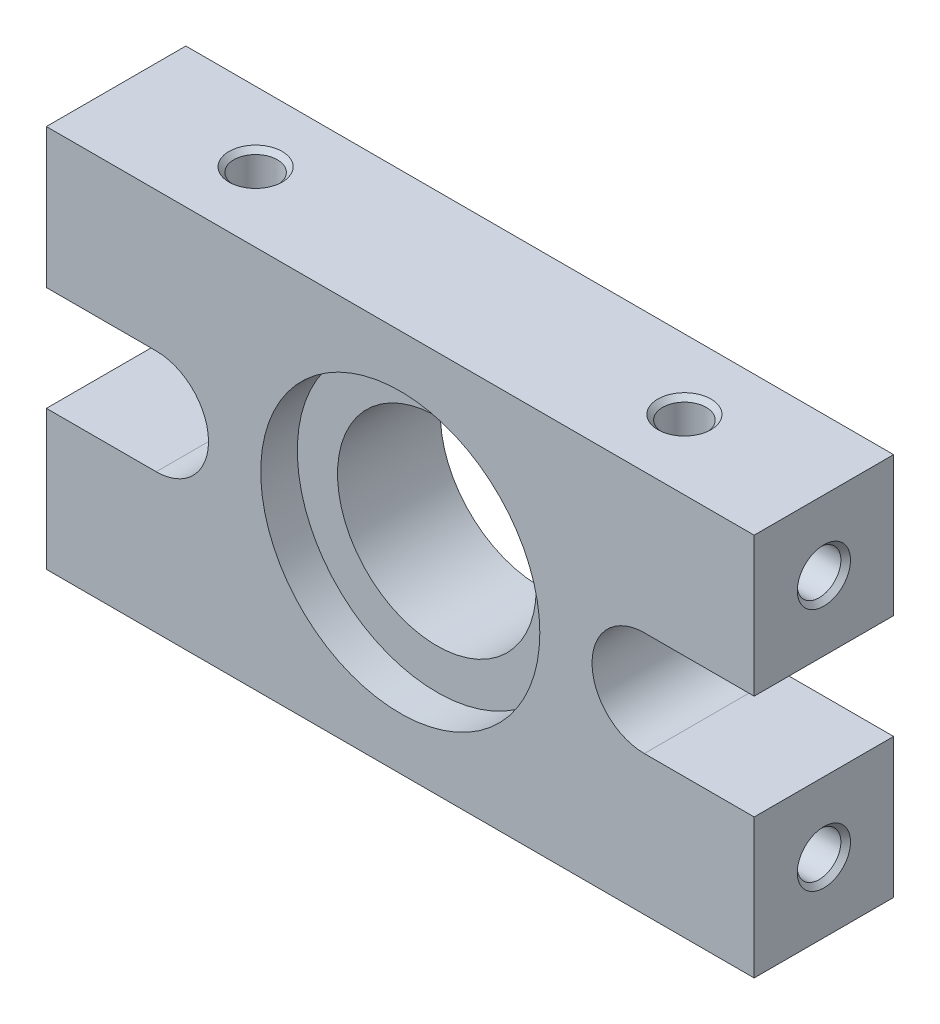
ISO-10303-21;
HEADER;
FILE_DESCRIPTION(('STEP AP214'),'2;1');
FILE_NAME('part.step','',(''),(''),'','','');
FILE_SCHEMA(('AUTOMOTIVE_DESIGN { 1 0 10303 214 1 1 1 1 }'));
ENDSEC;
DATA;
#1=APPLICATION_CONTEXT('core data for automotive mechanical design processes');
#2=APPLICATION_PROTOCOL_DEFINITION('international standard','automotive_design',2000,#1);
#3=PRODUCT_CONTEXT('',#1,'mechanical');
#4=PRODUCT('Part','Part','',(#3));
#5=PRODUCT_RELATED_PRODUCT_CATEGORY('part','',(#4));
#6=PRODUCT_DEFINITION_FORMATION('','',#4);
#7=PRODUCT_DEFINITION_CONTEXT('part definition',#1,'design');
#8=PRODUCT_DEFINITION('design','',#6,#7);
#9=PRODUCT_DEFINITION_SHAPE('','',#8);
#10=(LENGTH_UNIT() NAMED_UNIT(*) SI_UNIT(.MILLI.,.METRE.));
#11=(NAMED_UNIT(*) PLANE_ANGLE_UNIT() SI_UNIT($,.RADIAN.));
#12=(NAMED_UNIT(*) SI_UNIT($,.STERADIAN.) SOLID_ANGLE_UNIT());
#13=UNCERTAINTY_MEASURE_WITH_UNIT(LENGTH_MEASURE(1.E-05),#10,'distance_accuracy_value','');
#14=(GEOMETRIC_REPRESENTATION_CONTEXT(3) GLOBAL_UNCERTAINTY_ASSIGNED_CONTEXT((#13)) GLOBAL_UNIT_ASSIGNED_CONTEXT((#10,
#11,#12)) REPRESENTATION_CONTEXT('',''));
#15=CARTESIAN_POINT('',(0.,0.,0.));
#16=DIRECTION('',(0.,0.,1.));
#17=DIRECTION('',(1.,0.,0.));
#18=AXIS2_PLACEMENT_3D('',#15,#16,#17);
#19=CARTESIAN_POINT('',(20.3,11.,8.));
#20=DIRECTION('',(0.,0.,-1.));
#21=DIRECTION('',(-1.,0.,0.));
#22=AXIS2_PLACEMENT_3D('',#19,#20,#21);
#23=CYLINDRICAL_SURFACE('',#22,5.7);
#24=CARTESIAN_POINT('',(20.3,11.,0.));
#25=DIRECTION('',(0.,0.,1.));
#26=DIRECTION('',(1.,0.,0.));
#27=AXIS2_PLACEMENT_3D('',#24,#25,#26);
#28=CIRCLE('',#27,5.7);
#29=CARTESIAN_POINT('',(26.,11.,0.));
#30=VERTEX_POINT('',#29);
#31=EDGE_CURVE('E171',#30,#30,#28,.T.);
#32=ORIENTED_EDGE('',*,*,#31,.F.);
#33=EDGE_LOOP('',(#32));
#34=FACE_BOUND('',#33,.T.);
#35=CARTESIAN_POINT('',(20.3,11.,5.9));
#36=DIRECTION('',(0.,0.,1.));
#37=DIRECTION('',(1.,0.,0.));
#38=AXIS2_PLACEMENT_3D('',#35,#36,#37);
#39=CIRCLE('',#38,5.7);
#40=CARTESIAN_POINT('',(26.,11.,5.9));
#41=VERTEX_POINT('',#40);
#42=EDGE_CURVE('E214',#41,#41,#39,.T.);
#43=ORIENTED_EDGE('',*,*,#42,.T.);
#44=EDGE_LOOP('',(#43));
#45=FACE_BOUND('',#44,.T.);
#46=ADVANCED_FACE('F37',(#34,#45),#23,.F.);
#47=CARTESIAN_POINT('',(6.3,11.,8.));
#48=DIRECTION('',(0.,0.,1.));
#49=DIRECTION('',(1.,0.,0.));
#50=AXIS2_PLACEMENT_3D('',#47,#48,#49);
#51=PLANE('',#50);
#52=CARTESIAN_POINT('',(20.3,11.,8.));
#53=DIRECTION('',(0.,0.,1.));
#54=DIRECTION('',(1.,0.,0.));
#55=AXIS2_PLACEMENT_3D('',#52,#53,#54);
#56=CIRCLE('',#55,8.005);
#57=CARTESIAN_POINT('',(28.305,11.,8.));
#58=VERTEX_POINT('',#57);
#59=EDGE_CURVE('E358',#58,#58,#56,.T.);
#60=ORIENTED_EDGE('',*,*,#59,.F.);
#61=EDGE_LOOP('',(#60));
#62=FACE_BOUND('',#61,.T.);
#63=DIRECTION('',(0.,-1.,0.));
#64=VECTOR('',#63,1.);
#65=CARTESIAN_POINT('',(0.,0.,8.));
#66=LINE('',#65,#64);
#67=CARTESIAN_POINT('',(0.,8.,8.));
#68=VERTEX_POINT('',#67);
#69=CARTESIAN_POINT('',(0.,0.,8.));
#70=VERTEX_POINT('',#69);
#71=EDGE_CURVE('E190',#68,#70,#66,.T.);
#72=ORIENTED_EDGE('',*,*,#71,.T.);
#73=DIRECTION('',(1.,0.,0.));
#74=VECTOR('',#73,1.);
#75=CARTESIAN_POINT('',(0.,0.,8.));
#76=LINE('',#75,#74);
#77=CARTESIAN_POINT('',(40.6,0.,8.));
#78=VERTEX_POINT('',#77);
#79=EDGE_CURVE('E116',#70,#78,#76,.T.);
#80=ORIENTED_EDGE('',*,*,#79,.T.);
#81=DIRECTION('',(0.,1.,0.));
#82=VECTOR('',#81,1.);
#83=CARTESIAN_POINT('',(40.6,0.,8.));
#84=LINE('',#83,#82);
#85=CARTESIAN_POINT('',(40.6,8.,8.));
#86=VERTEX_POINT('',#85);
#87=EDGE_CURVE('E322',#78,#86,#84,.T.);
#88=ORIENTED_EDGE('',*,*,#87,.T.);
#89=DIRECTION('',(-1.,0.,0.));
#90=VECTOR('',#89,1.);
#91=CARTESIAN_POINT('',(40.6,8.,8.));
#92=LINE('',#91,#90);
#93=CARTESIAN_POINT('',(34.3,8.,8.));
#94=VERTEX_POINT('',#93);
#95=EDGE_CURVE('E334',#86,#94,#92,.T.);
#96=ORIENTED_EDGE('',*,*,#95,.T.);
#97=CARTESIAN_POINT('',(34.3,11.,8.));
#98=DIRECTION('',(0.,0.,-1.));
#99=DIRECTION('',(-1.,0.,0.));
#100=AXIS2_PLACEMENT_3D('',#97,#98,#99);
#101=CIRCLE('',#100,3.);
#102=CARTESIAN_POINT('',(34.3,14.,8.));
#103=VERTEX_POINT('',#102);
#104=EDGE_CURVE('E331',#94,#103,#101,.T.);
#105=ORIENTED_EDGE('',*,*,#104,.T.);
#106=DIRECTION('',(1.,0.,0.));
#107=VECTOR('',#106,1.);
#108=CARTESIAN_POINT('',(40.6,14.,8.));
#109=LINE('',#108,#107);
#110=CARTESIAN_POINT('',(40.6,14.,8.));
#111=VERTEX_POINT('',#110);
#112=EDGE_CURVE('E333',#103,#111,#109,.T.);
#113=ORIENTED_EDGE('',*,*,#112,.T.);
#114=DIRECTION('',(0.,1.,0.));
#115=VECTOR('',#114,1.);
#116=CARTESIAN_POINT('',(40.6,14.,8.));
#117=LINE('',#116,#115);
#118=CARTESIAN_POINT('',(40.6,22.,8.));
#119=VERTEX_POINT('',#118);
#120=EDGE_CURVE('E336',#111,#119,#117,.T.);
#121=ORIENTED_EDGE('',*,*,#120,.T.);
#122=DIRECTION('',(-1.,0.,0.));
#123=VECTOR('',#122,1.);
#124=CARTESIAN_POINT('',(0.,22.,8.));
#125=LINE('',#124,#123);
#126=CARTESIAN_POINT('',(0.,22.,8.));
#127=VERTEX_POINT('',#126);
#128=EDGE_CURVE('E342',#119,#127,#125,.T.);
#129=ORIENTED_EDGE('',*,*,#128,.T.);
#130=DIRECTION('',(0.,-1.,0.));
#131=VECTOR('',#130,1.);
#132=CARTESIAN_POINT('',(0.,14.,8.));
#133=LINE('',#132,#131);
#134=CARTESIAN_POINT('',(0.,14.,8.));
#135=VERTEX_POINT('',#134);
#136=EDGE_CURVE('E149',#127,#135,#133,.T.);
#137=ORIENTED_EDGE('',*,*,#136,.T.);
#138=DIRECTION('',(1.,0.,0.));
#139=VECTOR('',#138,1.);
#140=CARTESIAN_POINT('',(0.,14.,8.));
#141=LINE('',#140,#139);
#142=CARTESIAN_POINT('',(6.3,14.,8.));
#143=VERTEX_POINT('',#142);
#144=EDGE_CURVE('E143',#135,#143,#141,.T.);
#145=ORIENTED_EDGE('',*,*,#144,.T.);
#146=CARTESIAN_POINT('',(6.3,11.,8.));
#147=DIRECTION('',(0.,0.,-1.));
#148=DIRECTION('',(1.,0.,0.));
#149=AXIS2_PLACEMENT_3D('',#146,#147,#148);
#150=CIRCLE('',#149,3.);
#151=CARTESIAN_POINT('',(6.3,8.,8.));
#152=VERTEX_POINT('',#151);
#153=EDGE_CURVE('E147',#143,#152,#150,.T.);
#154=ORIENTED_EDGE('',*,*,#153,.T.);
#155=DIRECTION('',(-1.,0.,0.));
#156=VECTOR('',#155,1.);
#157=CARTESIAN_POINT('',(0.,8.,8.));
#158=LINE('',#157,#156);
#159=EDGE_CURVE('E60',#152,#68,#158,.T.);
#160=ORIENTED_EDGE('',*,*,#159,.T.);
#161=EDGE_LOOP('',(#72,#80,#88,#96,#105,#113,#121,#129,#137,#145,#154,#160));
#162=FACE_BOUND('',#161,.T.);
#163=ADVANCED_FACE('F145',(#62,#162),#51,.T.);
#164=CARTESIAN_POINT('',(6.3,11.,0.));
#165=DIRECTION('',(0.,0.,1.));
#166=DIRECTION('',(1.,0.,0.));
#167=AXIS2_PLACEMENT_3D('',#164,#165,#166);
#168=PLANE('',#167);
#169=DIRECTION('',(0.,-1.,0.));
#170=VECTOR('',#169,1.);
#171=CARTESIAN_POINT('',(0.,0.,0.));
#172=LINE('',#171,#170);
#173=CARTESIAN_POINT('',(0.,8.,0.));
#174=VERTEX_POINT('',#173);
#175=CARTESIAN_POINT('',(0.,0.,0.));
#176=VERTEX_POINT('',#175);
#177=EDGE_CURVE('E167',#174,#176,#172,.T.);
#178=ORIENTED_EDGE('',*,*,#177,.F.);
#179=DIRECTION('',(-1.,0.,0.));
#180=VECTOR('',#179,1.);
#181=CARTESIAN_POINT('',(0.,8.,0.));
#182=LINE('',#181,#180);
#183=CARTESIAN_POINT('',(6.3,8.,0.));
#184=VERTEX_POINT('',#183);
#185=EDGE_CURVE('E108',#184,#174,#182,.T.);
#186=ORIENTED_EDGE('',*,*,#185,.F.);
#187=CARTESIAN_POINT('',(6.3,11.,0.));
#188=DIRECTION('',(0.,0.,-1.));
#189=DIRECTION('',(1.,0.,0.));
#190=AXIS2_PLACEMENT_3D('',#187,#188,#189);
#191=CIRCLE('',#190,3.);
#192=CARTESIAN_POINT('',(6.3,14.,0.));
#193=VERTEX_POINT('',#192);
#194=EDGE_CURVE('E102',#193,#184,#191,.T.);
#195=ORIENTED_EDGE('',*,*,#194,.F.);
#196=DIRECTION('',(1.,0.,0.));
#197=VECTOR('',#196,1.);
#198=CARTESIAN_POINT('',(0.,14.,0.));
#199=LINE('',#198,#197);
#200=CARTESIAN_POINT('',(0.,14.,0.));
#201=VERTEX_POINT('',#200);
#202=EDGE_CURVE('E157',#201,#193,#199,.T.);
#203=ORIENTED_EDGE('',*,*,#202,.F.);
#204=DIRECTION('',(0.,-1.,0.));
#205=VECTOR('',#204,1.);
#206=CARTESIAN_POINT('',(0.,14.,0.));
#207=LINE('',#206,#205);
#208=CARTESIAN_POINT('',(0.,22.,0.));
#209=VERTEX_POINT('',#208);
#210=EDGE_CURVE('E185',#209,#201,#207,.T.);
#211=ORIENTED_EDGE('',*,*,#210,.F.);
#212=DIRECTION('',(-1.,0.,0.));
#213=VECTOR('',#212,1.);
#214=CARTESIAN_POINT('',(0.,22.,0.));
#215=LINE('',#214,#213);
#216=CARTESIAN_POINT('',(40.6,22.,0.));
#217=VERTEX_POINT('',#216);
#218=EDGE_CURVE('E183',#217,#209,#215,.T.);
#219=ORIENTED_EDGE('',*,*,#218,.F.);
#220=DIRECTION('',(0.,1.,0.));
#221=VECTOR('',#220,1.);
#222=CARTESIAN_POINT('',(40.6,14.,0.));
#223=LINE('',#222,#221);
#224=CARTESIAN_POINT('',(40.6,14.,0.));
#225=VERTEX_POINT('',#224);
#226=EDGE_CURVE('E181',#225,#217,#223,.T.);
#227=ORIENTED_EDGE('',*,*,#226,.F.);
#228=DIRECTION('',(1.,0.,0.));
#229=VECTOR('',#228,1.);
#230=CARTESIAN_POINT('',(40.6,14.,0.));
#231=LINE('',#230,#229);
#232=CARTESIAN_POINT('',(34.3,14.,0.));
#233=VERTEX_POINT('',#232);
#234=EDGE_CURVE('E179',#233,#225,#231,.T.);
#235=ORIENTED_EDGE('',*,*,#234,.F.);
#236=CARTESIAN_POINT('',(34.3,11.,0.));
#237=DIRECTION('',(0.,0.,-1.));
#238=DIRECTION('',(-1.,0.,0.));
#239=AXIS2_PLACEMENT_3D('',#236,#237,#238);
#240=CIRCLE('',#239,3.);
#241=CARTESIAN_POINT('',(34.3,8.,0.));
#242=VERTEX_POINT('',#241);
#243=EDGE_CURVE('E177',#242,#233,#240,.T.);
#244=ORIENTED_EDGE('',*,*,#243,.F.);
#245=DIRECTION('',(-1.,0.,0.));
#246=VECTOR('',#245,1.);
#247=CARTESIAN_POINT('',(40.6,8.,0.));
#248=LINE('',#247,#246);
#249=CARTESIAN_POINT('',(40.6,8.,0.));
#250=VERTEX_POINT('',#249);
#251=EDGE_CURVE('E175',#250,#242,#248,.T.);
#252=ORIENTED_EDGE('',*,*,#251,.F.);
#253=DIRECTION('',(0.,1.,0.));
#254=VECTOR('',#253,1.);
#255=CARTESIAN_POINT('',(40.6,0.,0.));
#256=LINE('',#255,#254);
#257=CARTESIAN_POINT('',(40.6,0.,0.));
#258=VERTEX_POINT('',#257);
#259=EDGE_CURVE('E173',#258,#250,#256,.T.);
#260=ORIENTED_EDGE('',*,*,#259,.F.);
#261=DIRECTION('',(1.,0.,0.));
#262=VECTOR('',#261,1.);
#263=CARTESIAN_POINT('',(0.,0.,0.));
#264=LINE('',#263,#262);
#265=EDGE_CURVE('E170',#176,#258,#264,.T.);
#266=ORIENTED_EDGE('',*,*,#265,.F.);
#267=EDGE_LOOP('',(#178,#186,#195,#203,#211,#219,#227,#235,#244,#252,#260,#266));
#268=FACE_BOUND('',#267,.T.);
#269=ORIENTED_EDGE('',*,*,#31,.T.);
#270=EDGE_LOOP('',(#269));
#271=FACE_BOUND('',#270,.T.);
#272=ADVANCED_FACE('F264',(#268,#271),#168,.F.);
#273=CARTESIAN_POINT('',(0.,0.,8.));
#274=DIRECTION('',(1.,0.,0.));
#275=DIRECTION('',(0.,0.,-1.));
#276=AXIS2_PLACEMENT_3D('',#273,#274,#275);
#277=PLANE('',#276);
#278=CARTESIAN_POINT('',(0.,4.,4.));
#279=DIRECTION('',(-1.,0.,0.));
#280=DIRECTION('',(0.,0.,1.));
#281=AXIS2_PLACEMENT_3D('',#278,#279,#280);
#282=CIRCLE('',#281,1.525);
#283=CARTESIAN_POINT('',(0.,4.,5.525));
#284=VERTEX_POINT('',#283);
#285=EDGE_CURVE('E403',#284,#284,#282,.T.);
#286=ORIENTED_EDGE('',*,*,#285,.F.);
#287=EDGE_LOOP('',(#286));
#288=FACE_BOUND('',#287,.T.);
#289=ORIENTED_EDGE('',*,*,#177,.T.);
#290=DIRECTION('',(0.,0.,-1.));
#291=VECTOR('',#290,1.);
#292=CARTESIAN_POINT('',(0.,0.,8.));
#293=LINE('',#292,#291);
#294=EDGE_CURVE('E11',#70,#176,#293,.T.);
#295=ORIENTED_EDGE('',*,*,#294,.F.);
#296=ORIENTED_EDGE('',*,*,#71,.F.);
#297=DIRECTION('',(0.,0.,-1.));
#298=VECTOR('',#297,1.);
#299=CARTESIAN_POINT('',(0.,8.,8.));
#300=LINE('',#299,#298);
#301=EDGE_CURVE('E163',#68,#174,#300,.T.);
#302=ORIENTED_EDGE('',*,*,#301,.T.);
#303=EDGE_LOOP('',(#289,#295,#296,#302));
#304=FACE_BOUND('',#303,.T.);
#305=ADVANCED_FACE('F39',(#288,#304),#277,.F.);
#306=CARTESIAN_POINT('',(0.,0.,8.));
#307=DIRECTION('',(0.,1.,0.));
#308=DIRECTION('',(0.,0.,1.));
#309=AXIS2_PLACEMENT_3D('',#306,#307,#308);
#310=PLANE('',#309);
#311=ORIENTED_EDGE('',*,*,#265,.T.);
#312=DIRECTION('',(0.,0.,-1.));
#313=VECTOR('',#312,1.);
#314=CARTESIAN_POINT('',(40.6,0.,8.));
#315=LINE('',#314,#313);
#316=EDGE_CURVE('E51',#78,#258,#315,.T.);
#317=ORIENTED_EDGE('',*,*,#316,.F.);
#318=ORIENTED_EDGE('',*,*,#79,.F.);
#319=ORIENTED_EDGE('',*,*,#294,.T.);
#320=EDGE_LOOP('',(#311,#317,#318,#319));
#321=FACE_BOUND('',#320,.T.);
#322=ADVANCED_FACE('F309',(#321),#310,.F.);
#323=CARTESIAN_POINT('',(40.6,0.,8.));
#324=DIRECTION('',(-1.,0.,0.));
#325=DIRECTION('',(0.,0.,1.));
#326=AXIS2_PLACEMENT_3D('',#323,#324,#325);
#327=PLANE('',#326);
#328=CARTESIAN_POINT('',(40.6,4.,4.));
#329=DIRECTION('',(1.,0.,0.));
#330=DIRECTION('',(0.,0.,-1.));
#331=AXIS2_PLACEMENT_3D('',#328,#329,#330);
#332=CIRCLE('',#331,1.525);
#333=CARTESIAN_POINT('',(40.6,4.,2.475));
#334=VERTEX_POINT('',#333);
#335=EDGE_CURVE('E394',#334,#334,#332,.T.);
#336=ORIENTED_EDGE('',*,*,#335,.F.);
#337=EDGE_LOOP('',(#336));
#338=FACE_BOUND('',#337,.T.);
#339=ORIENTED_EDGE('',*,*,#259,.T.);
#340=DIRECTION('',(0.,0.,-1.));
#341=VECTOR('',#340,1.);
#342=CARTESIAN_POINT('',(40.6,8.,8.));
#343=LINE('',#342,#341);
#344=EDGE_CURVE('E209',#86,#250,#343,.T.);
#345=ORIENTED_EDGE('',*,*,#344,.F.);
#346=ORIENTED_EDGE('',*,*,#87,.F.);
#347=ORIENTED_EDGE('',*,*,#316,.T.);
#348=EDGE_LOOP('',(#339,#345,#346,#347));
#349=FACE_BOUND('',#348,.T.);
#350=ADVANCED_FACE('F306',(#338,#349),#327,.F.);
#351=CARTESIAN_POINT('',(40.6,8.,8.));
#352=DIRECTION('',(0.,-1.,0.));
#353=DIRECTION('',(0.,0.,-1.));
#354=AXIS2_PLACEMENT_3D('',#351,#352,#353);
#355=PLANE('',#354);
#356=ORIENTED_EDGE('',*,*,#251,.T.);
#357=DIRECTION('',(0.,0.,-1.));
#358=VECTOR('',#357,1.);
#359=CARTESIAN_POINT('',(34.3,8.,8.));
#360=LINE('',#359,#358);
#361=EDGE_CURVE('E206',#94,#242,#360,.T.);
#362=ORIENTED_EDGE('',*,*,#361,.F.);
#363=ORIENTED_EDGE('',*,*,#95,.F.);
#364=ORIENTED_EDGE('',*,*,#344,.T.);
#365=EDGE_LOOP('',(#356,#362,#363,#364));
#366=FACE_BOUND('',#365,.T.);
#367=ADVANCED_FACE('F302',(#366),#355,.F.);
#368=CARTESIAN_POINT('',(34.3,11.,8.));
#369=DIRECTION('',(0.,0.,-1.));
#370=DIRECTION('',(-1.,0.,0.));
#371=AXIS2_PLACEMENT_3D('',#368,#369,#370);
#372=CYLINDRICAL_SURFACE('',#371,3.);
#373=ORIENTED_EDGE('',*,*,#243,.T.);
#374=DIRECTION('',(0.,0.,-1.));
#375=VECTOR('',#374,1.);
#376=CARTESIAN_POINT('',(34.3,14.,8.));
#377=LINE('',#376,#375);
#378=EDGE_CURVE('E203',#103,#233,#377,.T.);
#379=ORIENTED_EDGE('',*,*,#378,.F.);
#380=ORIENTED_EDGE('',*,*,#104,.F.);
#381=ORIENTED_EDGE('',*,*,#361,.T.);
#382=EDGE_LOOP('',(#373,#379,#380,#381));
#383=FACE_BOUND('',#382,.T.);
#384=ADVANCED_FACE('F298',(#383),#372,.F.);
#385=CARTESIAN_POINT('',(40.6,14.,8.));
#386=DIRECTION('',(0.,1.,0.));
#387=DIRECTION('',(0.,0.,1.));
#388=AXIS2_PLACEMENT_3D('',#385,#386,#387);
#389=PLANE('',#388);
#390=ORIENTED_EDGE('',*,*,#234,.T.);
#391=DIRECTION('',(0.,0.,-1.));
#392=VECTOR('',#391,1.);
#393=CARTESIAN_POINT('',(40.6,14.,8.));
#394=LINE('',#393,#392);
#395=EDGE_CURVE('E200',#111,#225,#394,.T.);
#396=ORIENTED_EDGE('',*,*,#395,.F.);
#397=ORIENTED_EDGE('',*,*,#112,.F.);
#398=ORIENTED_EDGE('',*,*,#378,.T.);
#399=EDGE_LOOP('',(#390,#396,#397,#398));
#400=FACE_BOUND('',#399,.T.);
#401=ADVANCED_FACE('F294',(#400),#389,.F.);
#402=CARTESIAN_POINT('',(40.6,14.,8.));
#403=DIRECTION('',(-1.,0.,0.));
#404=DIRECTION('',(0.,0.,1.));
#405=AXIS2_PLACEMENT_3D('',#402,#403,#404);
#406=PLANE('',#405);
#407=CARTESIAN_POINT('',(40.6,18.,4.));
#408=DIRECTION('',(1.,0.,0.));
#409=DIRECTION('',(0.,0.,-1.));
#410=AXIS2_PLACEMENT_3D('',#407,#408,#409);
#411=CIRCLE('',#410,1.525);
#412=CARTESIAN_POINT('',(40.6,18.,2.475));
#413=VERTEX_POINT('',#412);
#414=EDGE_CURVE('E385',#413,#413,#411,.T.);
#415=ORIENTED_EDGE('',*,*,#414,.F.);
#416=EDGE_LOOP('',(#415));
#417=FACE_BOUND('',#416,.T.);
#418=ORIENTED_EDGE('',*,*,#226,.T.);
#419=DIRECTION('',(0.,0.,-1.));
#420=VECTOR('',#419,1.);
#421=CARTESIAN_POINT('',(40.6,22.,8.));
#422=LINE('',#421,#420);
#423=EDGE_CURVE('E197',#119,#217,#422,.T.);
#424=ORIENTED_EDGE('',*,*,#423,.F.);
#425=ORIENTED_EDGE('',*,*,#120,.F.);
#426=ORIENTED_EDGE('',*,*,#395,.T.);
#427=EDGE_LOOP('',(#418,#424,#425,#426));
#428=FACE_BOUND('',#427,.T.);
#429=ADVANCED_FACE('F290',(#417,#428),#406,.F.);
#430=CARTESIAN_POINT('',(0.,22.,8.));
#431=DIRECTION('',(0.,-1.,0.));
#432=DIRECTION('',(0.,0.,-1.));
#433=AXIS2_PLACEMENT_3D('',#430,#431,#432);
#434=PLANE('',#433);
#435=CARTESIAN_POINT('',(8.,22.,4.));
#436=DIRECTION('',(0.,1.,0.));
#437=DIRECTION('',(0.,0.,1.));
#438=AXIS2_PLACEMENT_3D('',#435,#436,#437);
#439=CIRCLE('',#438,1.525);
#440=CARTESIAN_POINT('',(8.,22.,5.525));
#441=VERTEX_POINT('',#440);
#442=EDGE_CURVE('E223',#441,#441,#439,.T.);
#443=ORIENTED_EDGE('',*,*,#442,.F.);
#444=EDGE_LOOP('',(#443));
#445=FACE_BOUND('',#444,.T.);
#446=CARTESIAN_POINT('',(32.6,22.,4.));
#447=DIRECTION('',(0.,1.,0.));
#448=DIRECTION('',(0.,0.,1.));
#449=AXIS2_PLACEMENT_3D('',#446,#447,#448);
#450=CIRCLE('',#449,1.525);
#451=CARTESIAN_POINT('',(32.6,22.,5.525));
#452=VERTEX_POINT('',#451);
#453=EDGE_CURVE('E369',#452,#452,#450,.T.);
#454=ORIENTED_EDGE('',*,*,#453,.F.);
#455=EDGE_LOOP('',(#454));
#456=FACE_BOUND('',#455,.T.);
#457=ORIENTED_EDGE('',*,*,#218,.T.);
#458=DIRECTION('',(0.,0.,-1.));
#459=VECTOR('',#458,1.);
#460=CARTESIAN_POINT('',(0.,22.,8.));
#461=LINE('',#460,#459);
#462=EDGE_CURVE('E194',#127,#209,#461,.T.);
#463=ORIENTED_EDGE('',*,*,#462,.F.);
#464=ORIENTED_EDGE('',*,*,#128,.F.);
#465=ORIENTED_EDGE('',*,*,#423,.T.);
#466=EDGE_LOOP('',(#457,#463,#464,#465));
#467=FACE_BOUND('',#466,.T.);
#468=ADVANCED_FACE('F286',(#445,#456,#467),#434,.F.);
#469=CARTESIAN_POINT('',(0.,14.,8.));
#470=DIRECTION('',(1.,0.,0.));
#471=DIRECTION('',(0.,0.,-1.));
#472=AXIS2_PLACEMENT_3D('',#469,#470,#471);
#473=PLANE('',#472);
#474=CARTESIAN_POINT('',(0.,18.,4.));
#475=DIRECTION('',(-1.,0.,0.));
#476=DIRECTION('',(0.,0.,1.));
#477=AXIS2_PLACEMENT_3D('',#474,#475,#476);
#478=CIRCLE('',#477,1.525);
#479=CARTESIAN_POINT('',(0.,18.,5.525));
#480=VERTEX_POINT('',#479);
#481=EDGE_CURVE('E412',#480,#480,#478,.T.);
#482=ORIENTED_EDGE('',*,*,#481,.F.);
#483=EDGE_LOOP('',(#482));
#484=FACE_BOUND('',#483,.T.);
#485=ORIENTED_EDGE('',*,*,#210,.T.);
#486=DIRECTION('',(0.,0.,-1.));
#487=VECTOR('',#486,1.);
#488=CARTESIAN_POINT('',(0.,14.,8.));
#489=LINE('',#488,#487);
#490=EDGE_CURVE('E158',#135,#201,#489,.T.);
#491=ORIENTED_EDGE('',*,*,#490,.F.);
#492=ORIENTED_EDGE('',*,*,#136,.F.);
#493=ORIENTED_EDGE('',*,*,#462,.T.);
#494=EDGE_LOOP('',(#485,#491,#492,#493));
#495=FACE_BOUND('',#494,.T.);
#496=ADVANCED_FACE('F283',(#484,#495),#473,.F.);
#497=CARTESIAN_POINT('',(0.,14.,8.));
#498=DIRECTION('',(0.,1.,0.));
#499=DIRECTION('',(0.,0.,1.));
#500=AXIS2_PLACEMENT_3D('',#497,#498,#499);
#501=PLANE('',#500);
#502=ORIENTED_EDGE('',*,*,#202,.T.);
#503=DIRECTION('',(0.,0.,-1.));
#504=VECTOR('',#503,1.);
#505=CARTESIAN_POINT('',(6.3,14.,8.));
#506=LINE('',#505,#504);
#507=EDGE_CURVE('E154',#143,#193,#506,.T.);
#508=ORIENTED_EDGE('',*,*,#507,.F.);
#509=ORIENTED_EDGE('',*,*,#144,.F.);
#510=ORIENTED_EDGE('',*,*,#490,.T.);
#511=EDGE_LOOP('',(#502,#508,#509,#510));
#512=FACE_BOUND('',#511,.T.);
#513=ADVANCED_FACE('F155',(#512),#501,.F.);
#514=CARTESIAN_POINT('',(6.3,11.,8.));
#515=DIRECTION('',(0.,0.,-1.));
#516=DIRECTION('',(-1.,0.,0.));
#517=AXIS2_PLACEMENT_3D('',#514,#515,#516);
#518=CYLINDRICAL_SURFACE('',#517,3.);
#519=ORIENTED_EDGE('',*,*,#194,.T.);
#520=DIRECTION('',(0.,0.,-1.));
#521=VECTOR('',#520,1.);
#522=CARTESIAN_POINT('',(6.3,8.,8.));
#523=LINE('',#522,#521);
#524=EDGE_CURVE('E159',#152,#184,#523,.T.);
#525=ORIENTED_EDGE('',*,*,#524,.F.);
#526=ORIENTED_EDGE('',*,*,#153,.F.);
#527=ORIENTED_EDGE('',*,*,#507,.T.);
#528=EDGE_LOOP('',(#519,#525,#526,#527));
#529=FACE_BOUND('',#528,.T.);
#530=ADVANCED_FACE('F161',(#529),#518,.F.);
#531=CARTESIAN_POINT('',(0.,8.,8.));
#532=DIRECTION('',(0.,-1.,0.));
#533=DIRECTION('',(0.,0.,-1.));
#534=AXIS2_PLACEMENT_3D('',#531,#532,#533);
#535=PLANE('',#534);
#536=ORIENTED_EDGE('',*,*,#185,.T.);
#537=ORIENTED_EDGE('',*,*,#301,.F.);
#538=ORIENTED_EDGE('',*,*,#159,.F.);
#539=ORIENTED_EDGE('',*,*,#524,.T.);
#540=EDGE_LOOP('',(#536,#537,#538,#539));
#541=FACE_BOUND('',#540,.T.);
#542=ADVANCED_FACE('F276',(#541),#535,.F.);
#543=CARTESIAN_POINT('',(20.3,11.,5.9));
#544=DIRECTION('',(0.,0.,1.));
#545=DIRECTION('',(1.,0.,0.));
#546=AXIS2_PLACEMENT_3D('',#543,#544,#545);
#547=CYLINDRICAL_SURFACE('',#546,8.005);
#548=CARTESIAN_POINT('',(20.3,11.,5.9));
#549=DIRECTION('',(0.,0.,1.));
#550=DIRECTION('',(1.,0.,0.));
#551=AXIS2_PLACEMENT_3D('',#548,#549,#550);
#552=CIRCLE('',#551,8.005);
#553=CARTESIAN_POINT('',(28.305,11.,5.9));
#554=VERTEX_POINT('',#553);
#555=EDGE_CURVE('E216',#554,#554,#552,.T.);
#556=ORIENTED_EDGE('',*,*,#555,.F.);
#557=EDGE_LOOP('',(#556));
#558=FACE_BOUND('',#557,.T.);
#559=ORIENTED_EDGE('',*,*,#59,.T.);
#560=EDGE_LOOP('',(#559));
#561=FACE_BOUND('',#560,.T.);
#562=ADVANCED_FACE('F270',(#558,#561),#547,.F.);
#563=CARTESIAN_POINT('',(20.3,11.,5.9));
#564=DIRECTION('',(0.,0.,1.));
#565=DIRECTION('',(1.,0.,0.));
#566=AXIS2_PLACEMENT_3D('',#563,#564,#565);
#567=PLANE('',#566);
#568=ORIENTED_EDGE('',*,*,#42,.F.);
#569=EDGE_LOOP('',(#568));
#570=FACE_BOUND('',#569,.T.);
#571=ORIENTED_EDGE('',*,*,#555,.T.);
#572=EDGE_LOOP('',(#571));
#573=FACE_BOUND('',#572,.T.);
#574=ADVANCED_FACE('F479',(#570,#573),#567,.T.);
#575=CARTESIAN_POINT('',(32.6,17.,4.));
#576=DIRECTION('',(0.,1.,0.));
#577=DIRECTION('',(0.,0.,1.));
#578=AXIS2_PLACEMENT_3D('',#575,#576,#577);
#579=CONICAL_SURFACE('',#578,1.25,1.02974425867666);
#580=CARTESIAN_POINT('',(32.6,16.2489242262155,4.));
#581=VERTEX_POINT('',#580);
#582=VERTEX_LOOP('',#581);
#583=FACE_BOUND('',#582,.T.);
#584=CARTESIAN_POINT('',(32.6,17.,4.));
#585=DIRECTION('',(0.,1.,0.));
#586=DIRECTION('',(0.,0.,1.));
#587=AXIS2_PLACEMENT_3D('',#584,#585,#586);
#588=CIRCLE('',#587,1.25);
#589=CARTESIAN_POINT('',(32.6,17.,5.25));
#590=VERTEX_POINT('',#589);
#591=EDGE_CURVE('E361',#590,#590,#588,.T.);
#592=ORIENTED_EDGE('',*,*,#591,.T.);
#593=EDGE_LOOP('',(#592));
#594=FACE_BOUND('',#593,.T.);
#595=ADVANCED_FACE('F254',(#583,#594),#579,.F.);
#596=CARTESIAN_POINT('',(32.6,22.,4.));
#597=DIRECTION('',(0.,1.,0.));
#598=DIRECTION('',(0.,0.,1.));
#599=AXIS2_PLACEMENT_3D('',#596,#597,#598);
#600=CYLINDRICAL_SURFACE('',#599,1.24999999999999);
#601=CARTESIAN_POINT('',(33.7265347254094,17.6813636183456,3.45831788621234));
#602=CARTESIAN_POINT('',(33.7187229237915,17.7346462775819,3.4420653589481));
#603=CARTESIAN_POINT('',(33.7124969745409,17.7894930151401,3.4299758347188));
#604=CARTESIAN_POINT('',(33.7043092928994,17.9007423664999,3.41426901146885));
#605=CARTESIAN_POINT('',(33.7023522778529,17.957146631832,3.41066108461373));
#606=CARTESIAN_POINT('',(33.7030782786974,18.0693074847651,3.41202159799883));
#607=CARTESIAN_POINT('',(33.7057188869716,18.1250652666566,3.4169116536485));
#608=CARTESIAN_POINT('',(33.7150770545864,18.2349247523806,3.43501806129106));
#609=CARTESIAN_POINT('',(33.7217999471645,18.2890241924096,3.44824530613685));
#610=CARTESIAN_POINT('',(33.7382367482522,18.3942353852525,3.48300114935819));
#611=CARTESIAN_POINT('',(33.7479622329977,18.4453346475346,3.50456195956991));
#612=CARTESIAN_POINT('',(33.7689295563923,18.5426307444122,3.5562828783744));
#613=CARTESIAN_POINT('',(33.7801674880709,18.5888396798144,3.58642104632542));
#614=CARTESIAN_POINT('',(33.7975119984833,18.6552409136658,3.64098767426483));
#615=CARTESIAN_POINT('',(33.8037322176371,18.6780309537298,3.66223233840281));
#616=CARTESIAN_POINT('',(33.8156259969294,18.7203165900053,3.70792178246451));
#617=CARTESIAN_POINT('',(33.8213004738448,18.739817754169,3.73236102695597));
#618=CARTESIAN_POINT('',(33.8304909612616,18.7707620620749,3.77901872274386));
#619=CARTESIAN_POINT('',(33.8342103937437,18.7830375646895,3.80064025450295));
#620=CARTESIAN_POINT('',(33.840647333943,18.8040510907912,3.84569432406732));
#621=CARTESIAN_POINT('',(33.8433656284032,18.8127918925503,3.86912542223372));
#622=CARTESIAN_POINT('',(33.8475148095015,18.826063096092,3.9175329159222));
#623=CARTESIAN_POINT('',(33.8489331494378,18.8305524781621,3.94252193537185));
#624=CARTESIAN_POINT('',(33.8502335024828,18.8346704283273,3.99293312546389));
#625=CARTESIAN_POINT('',(33.8501167109186,18.83430277834,4.01835494370506));
#626=CARTESIAN_POINT('',(33.8484986321367,18.8291740580191,4.06491581536277));
#627=CARTESIAN_POINT('',(33.8472020960441,18.8250626612011,4.08613798354226));
#628=CARTESIAN_POINT('',(33.8436422182535,18.8136767887362,4.12762497501402));
#629=CARTESIAN_POINT('',(33.8413784116621,18.8064007920761,4.14788933275144));
#630=CARTESIAN_POINT('',(33.8351597577371,18.7861692382653,4.1938786210788));
#631=CARTESIAN_POINT('',(33.8308909934958,18.7721204752665,4.21907827766582));
#632=CARTESIAN_POINT('',(33.8214405056635,18.7402770865222,4.26679231328763));
#633=CARTESIAN_POINT('',(33.8162568812427,18.7224746463672,4.28930093449844));
#634=CARTESIAN_POINT('',(33.8029937297651,18.6755081621008,4.34103398078339));
#635=CARTESIAN_POINT('',(33.7946514289935,18.644812008054,4.36879420105099));
#636=CARTESIAN_POINT('',(33.7779535981401,18.5794114385774,4.41907976404549));
#637=CARTESIAN_POINT('',(33.7695980776268,18.5446986424545,4.44159385488723));
#638=CARTESIAN_POINT('',(33.7511439482189,18.4610571876952,4.48803154802124));
#639=CARTESIAN_POINT('',(33.7413195268043,18.4110823126659,4.51018630935251));
#640=CARTESIAN_POINT('',(33.724431353136,18.307890514368,4.54639920565557));
#641=CARTESIAN_POINT('',(33.7173670279882,18.2546742665423,4.56045902112657));
#642=CARTESIAN_POINT('',(33.7070962786768,18.1460996484058,4.58048927975365));
#643=CARTESIAN_POINT('',(33.7039080625468,18.0907324192246,4.58642156019959));
#644=CARTESIAN_POINT('',(33.7020334141356,17.9796723424683,4.58993816411441));
#645=CARTESIAN_POINT('',(33.7033455194713,17.9239796065383,4.58752519937496));
#646=CARTESIAN_POINT('',(33.7102110063418,17.8140226405255,4.5744418921936));
#647=CARTESIAN_POINT('',(33.7157519635633,17.7597547066408,4.56379573754299));
#648=CARTESIAN_POINT('',(33.7301295023205,17.6538587304709,4.53439206317959));
#649=CARTESIAN_POINT('',(33.7389686568857,17.6022327851368,4.51562820876217));
#650=CARTESIAN_POINT('',(33.7568155206074,17.5121917470351,4.47401627465145));
#651=CARTESIAN_POINT('',(33.7655011001298,17.4730801415201,4.45252875171599));
#652=CARTESIAN_POINT('',(33.7833058069163,17.3988201466811,4.40368740553933));
#653=CARTESIAN_POINT('',(33.7924239574519,17.3636633813675,4.37634635049476));
#654=CARTESIAN_POINT('',(33.8070190674882,17.3100909597271,4.32564425058318));
#655=CARTESIAN_POINT('',(33.8126835704635,17.2900373969795,4.30407004278702));
#656=CARTESIAN_POINT('',(33.8233051334528,17.2533278667425,4.25803229581603));
#657=CARTESIAN_POINT('',(33.8282632435093,17.2366668401345,4.23357314612544));
#658=CARTESIAN_POINT('',(33.8360760973436,17.2108250670706,4.18721285175961));
#659=CARTESIAN_POINT('',(33.8391536913703,17.2008108113978,4.1658179025739));
#660=CARTESIAN_POINT('',(33.8442708382269,17.1842909468033,4.12158879328976));
#661=CARTESIAN_POINT('',(33.8463113445135,17.1777821148068,4.09875597689734));
#662=CARTESIAN_POINT('',(33.8491359480011,17.1687978625615,4.05205125234566));
#663=CARTESIAN_POINT('',(33.8499112589005,17.1663506467125,4.02817325029631));
#664=CARTESIAN_POINT('',(33.8500741574051,17.1658352261027,3.98036597811156));
#665=CARTESIAN_POINT('',(33.849461988933,17.1677662516355,3.9564367177264));
#666=CARTESIAN_POINT('',(33.8470678830038,17.1753727964406,3.91186537638482));
#667=CARTESIAN_POINT('',(33.845415965966,17.1806324302462,3.89114256078509));
#668=CARTESIAN_POINT('',(33.8412278392956,17.194097901535,3.85078267048604));
#669=CARTESIAN_POINT('',(33.8386912993688,17.2023048394956,3.83114600450277));
#670=CARTESIAN_POINT('',(33.8316957708629,17.2252413160395,3.78511580535682));
#671=CARTESIAN_POINT('',(33.8268784451956,17.2412595150502,3.75942003438052));
#672=CARTESIAN_POINT('',(33.8163891511719,17.2770943460809,3.71101082986931));
#673=CARTESIAN_POINT('',(33.8107148812956,17.2969212474736,3.68830574563989));
#674=CARTESIAN_POINT('',(33.7963195482852,17.3490214060882,3.63620445200278));
#675=CARTESIAN_POINT('',(33.7873835674338,17.382861915337,3.60844220360147));
#676=CARTESIAN_POINT('',(33.7697970653355,17.4545187723273,3.55867157116049));
#677=CARTESIAN_POINT('',(33.7611466053263,17.4923359657886,3.5366644145377));
#678=CARTESIAN_POINT('',(33.7481066428065,17.5555944971234,3.50551648135184));
#679=CARTESIAN_POINT('',(33.7433647485603,17.5801543173213,3.49469416658743));
#680=CARTESIAN_POINT('',(33.7344697428501,17.6301420030687,3.47502915657422));
#681=CARTESIAN_POINT('',(33.7303164104489,17.6555695384196,3.46618571775943));
#682=CARTESIAN_POINT('',(33.7265347254094,17.6813636183456,3.45831788621234));
#683=B_SPLINE_CURVE_WITH_KNOTS('',3,(#601,#602,#603,#604,#605,#606,#607,#608,#609,#610,#611,
#612,#613,#614,#615,#616,#617,#618,#619,#620,#621,#622,#623,#624,#625,#626,#627,#628,#629,#630,
#631,#632,#633,#634,#635,#636,#637,#638,#639,#640,#641,#642,#643,#644,#645,#646,#647,#648,#649,
#650,#651,#652,#653,#654,#655,#656,#657,#658,#659,#660,#661,#662,#663,#664,#665,#666,#667,#668,
#669,#670,#671,#672,#673,#674,#675,#676,#677,#678,#679,#680,#681,#682),.UNSPECIFIED.,.T.,.F.,(4,
2,2,2,2,2,2,2,2,2,2,2,2,2,2,2,2,2,2,2,2,2,2,2,2,2,2,2,2,2,2,2,2,2,2,2,2,2,2,2,4),(0.,
0.168652935787078,0.337492145656678,0.504782252998042,0.672291385548493,0.840454574920477,
1.00819141526996,1.10325277551613,1.19815154851554,1.27329341230475,1.34837609931505,
1.4241760525666,1.49991698782941,1.5645930603596,1.62930025279494,1.71631019839321,
1.80350310212449,1.92946715617565,2.05569894068669,2.22148438947851,2.38723540902627,
2.55376207285887,2.72023462885232,2.88621996447306,3.05233506223044,3.18828279638191,
3.32393695789566,3.41366032218223,3.50324889047996,3.57443957081166,3.6455646823759,
3.71718166071049,3.78878604956533,3.85284741060692,3.91693271607344,4.00839914836433,
4.10011575313473,4.23341797035716,4.36674859445903,4.44842404670263,4.53006875752941),.UNSPECIFIED.);
#684=CARTESIAN_POINT('',(33.7265347254094,17.6813636183456,3.45831788621234));
#685=VERTEX_POINT('',#684);
#686=EDGE_CURVE('E217',#685,#685,#683,.T.);
#687=ORIENTED_EDGE('',*,*,#686,.T.);
#688=EDGE_LOOP('',(#687));
#689=FACE_BOUND('',#688,.T.);
#690=ORIENTED_EDGE('',*,*,#591,.F.);
#691=EDGE_LOOP('',(#690));
#692=FACE_BOUND('',#691,.T.);
#693=CARTESIAN_POINT('',(32.6,21.725,4.));
#694=DIRECTION('',(0.,1.,0.));
#695=DIRECTION('',(0.,0.,1.));
#696=AXIS2_PLACEMENT_3D('',#693,#694,#695);
#697=CIRCLE('',#696,1.24999999999999);
#698=CARTESIAN_POINT('',(32.6,21.725,5.24999999999999));
#699=VERTEX_POINT('',#698);
#700=EDGE_CURVE('E366',#699,#699,#697,.T.);
#701=ORIENTED_EDGE('',*,*,#700,.T.);
#702=EDGE_LOOP('',(#701));
#703=FACE_BOUND('',#702,.T.);
#704=ADVANCED_FACE('F225',(#689,#692,#703),#600,.F.);
#705=CARTESIAN_POINT('',(32.6,22.,4.));
#706=DIRECTION('',(0.,1.,0.));
#707=DIRECTION('',(0.,0.,1.));
#708=AXIS2_PLACEMENT_3D('',#705,#706,#707);
#709=CONICAL_SURFACE('',#708,1.525,0.785398163397474);
#710=ORIENTED_EDGE('',*,*,#700,.F.);
#711=EDGE_LOOP('',(#710));
#712=FACE_BOUND('',#711,.T.);
#713=ORIENTED_EDGE('',*,*,#453,.T.);
#714=EDGE_LOOP('',(#713));
#715=FACE_BOUND('',#714,.T.);
#716=ADVANCED_FACE('F247',(#712,#715),#709,.F.);
#717=CARTESIAN_POINT('',(8.,17.,4.));
#718=DIRECTION('',(0.,1.,0.));
#719=DIRECTION('',(0.,0.,1.));
#720=AXIS2_PLACEMENT_3D('',#717,#718,#719);
#721=CONICAL_SURFACE('',#720,1.25,1.02974425867665);
#722=CARTESIAN_POINT('',(8.,16.2489242262155,4.));
#723=VERTEX_POINT('',#722);
#724=VERTEX_LOOP('',#723);
#725=FACE_BOUND('',#724,.T.);
#726=CARTESIAN_POINT('',(8.,17.,4.));
#727=DIRECTION('',(0.,1.,0.));
#728=DIRECTION('',(0.,0.,1.));
#729=AXIS2_PLACEMENT_3D('',#726,#727,#728);
#730=CIRCLE('',#729,1.25);
#731=CARTESIAN_POINT('',(8.,17.,5.25));
#732=VERTEX_POINT('',#731);
#733=EDGE_CURVE('E372',#732,#732,#730,.T.);
#734=ORIENTED_EDGE('',*,*,#733,.T.);
#735=EDGE_LOOP('',(#734));
#736=FACE_BOUND('',#735,.T.);
#737=ADVANCED_FACE('F244',(#725,#736),#721,.F.);
#738=CARTESIAN_POINT('',(8.,22.,4.));
#739=DIRECTION('',(0.,1.,0.));
#740=DIRECTION('',(0.,0.,1.));
#741=AXIS2_PLACEMENT_3D('',#738,#739,#740);
#742=CYLINDRICAL_SURFACE('',#741,1.24999999999999);
#743=CARTESIAN_POINT('',(6.8734652745906,17.6813636183456,3.45831788621234));
#744=CARTESIAN_POINT('',(6.86575082340727,17.6287727542347,3.47435676353604));
#745=CARTESIAN_POINT('',(6.85648132748961,17.5776065308132,3.49447424180244));
#746=CARTESIAN_POINT('',(6.83619865419715,17.4797173530749,3.54309428945807));
#747=CARTESIAN_POINT('',(6.8251858298418,17.4329935022488,3.57159516223248));
#748=CARTESIAN_POINT('',(6.80758404244442,17.3638824509678,3.62440097450759));
#749=CARTESIAN_POINT('',(6.80099575237494,17.3392607339289,3.64578957606482));
#750=CARTESIAN_POINT('',(6.78829428919995,17.2933829299758,3.69203408590077));
#751=CARTESIAN_POINT('',(6.78218019776756,17.2721202507186,3.71688301797051));
#752=CARTESIAN_POINT('',(6.77227886337555,17.2384766185077,3.76411073011198));
#753=CARTESIAN_POINT('',(6.76827780268594,17.225174021763,3.78578328950847));
#754=CARTESIAN_POINT('',(6.7612533260878,17.2021067877949,3.83109328008732));
#755=CARTESIAN_POINT('',(6.75822864106344,17.1923375558149,3.85472810998723));
#756=CARTESIAN_POINT('',(6.75384893418279,17.1782849155571,3.89980144708905));
#757=CARTESIAN_POINT('',(6.75231058407171,17.1733953095107,3.92103155567142));
#758=CARTESIAN_POINT('',(6.75033192216221,17.1671163434823,3.96405304126547));
#759=CARTESIAN_POINT('',(6.74989092319218,17.1657247929794,3.98584405838769));
#760=CARTESIAN_POINT('',(6.75015531531303,17.1665612141253,4.02936089598378));
#761=CARTESIAN_POINT('',(6.7508613770461,17.1687913032069,4.0510866708718));
#762=CARTESIAN_POINT('',(6.75334301217572,17.1766810999024,4.09384183282049));
#763=CARTESIAN_POINT('',(6.75511932757584,17.1823431869264,4.11487072605438));
#764=CARTESIAN_POINT('',(6.76010334485711,17.1983946040698,4.16063899880078));
#765=CARTESIAN_POINT('',(6.76355129848645,17.2095889863907,4.18506816504693));
#766=CARTESIAN_POINT('',(6.77143144987253,17.2356607549025,4.23169310892719));
#767=CARTESIAN_POINT('',(6.77586535664691,17.2505445413844,4.25388491011515));
#768=CARTESIAN_POINT('',(6.78732137773719,17.289962162183,4.30470533154016));
#769=CARTESIAN_POINT('',(6.79465065999554,17.3159291795561,4.33214717896186));
#770=CARTESIAN_POINT('',(6.80967418013625,17.3718222075651,4.3825139588069));
#771=CARTESIAN_POINT('',(6.81736918763481,17.4017568275877,4.40542879070039));
#772=CARTESIAN_POINT('',(6.83539610290859,17.4766658673796,4.45513184559952));
#773=CARTESIAN_POINT('',(6.84559208145334,17.5229677551127,4.47997071258435));
#774=CARTESIAN_POINT('',(6.86400223534924,17.619235001605,4.52204815149229));
#775=CARTESIAN_POINT('',(6.87221537084125,17.6692022647601,4.53928273941947));
#776=CARTESIAN_POINT('',(6.88560054363948,17.7722533621597,4.56643450446608));
#777=CARTESIAN_POINT('',(6.89072848058948,17.8253709902585,4.57624606204848));
#778=CARTESIAN_POINT('',(6.89691782870773,17.9326491240063,4.58800955603272));
#779=CARTESIAN_POINT('',(6.89798369140608,17.9868084226335,4.58997009629655));
#780=CARTESIAN_POINT('',(6.89583984201693,18.0963670565293,4.58594887436513));
#781=CARTESIAN_POINT('',(6.89250156098396,18.1517551528016,4.57972829994351));
#782=CARTESIAN_POINT('',(6.8819144932421,18.2607021083046,4.55903247203034));
#783=CARTESIAN_POINT('',(6.87465687359612,18.3142565440218,4.54453856887686));
#784=CARTESIAN_POINT('',(6.85732416151324,18.418456058293,4.50716957895172));
#785=CARTESIAN_POINT('',(6.84722294813385,18.469068650082,4.48421614890783));
#786=CARTESIAN_POINT('',(6.82576080202975,18.5650074990931,4.42956465227903));
#787=CARTESIAN_POINT('',(6.81440415693438,18.6103507267661,4.39789583079845));
#788=CARTESIAN_POINT('',(6.7974419677876,18.6737916427197,4.34172195630781));
#789=CARTESIAN_POINT('',(6.79159070053255,18.6948377605704,4.32060732560508));
#790=CARTESIAN_POINT('',(6.78050022374981,18.7336850757187,4.27542750726347));
#791=CARTESIAN_POINT('',(6.77526003837406,18.7514914727898,4.25136715326342));
#792=CARTESIAN_POINT('',(6.76678776762943,18.7797688680724,4.20524657224591));
#793=CARTESIAN_POINT('',(6.76336330046101,18.7909916821823,4.18368690302955));
#794=CARTESIAN_POINT('',(6.75753971429436,18.8098972479012,4.13892453566117));
#795=CARTESIAN_POINT('',(6.75513975923037,18.8175828864677,4.11572319531136));
#796=CARTESIAN_POINT('',(6.75162123652032,18.8288043856649,4.06801379745922));
#797=CARTESIAN_POINT('',(6.75051352343184,18.8323050997965,4.04349645512306));
#798=CARTESIAN_POINT('',(6.74977100352252,18.8346549901133,3.99422031873339));
#799=CARTESIAN_POINT('',(6.7501354664164,18.8335064725883,3.96946165047092));
#800=CARTESIAN_POINT('',(6.75214109864254,18.8271429225082,3.92382834782794));
#801=CARTESIAN_POINT('',(6.75361067102546,18.8224742462381,3.90286621948164));
#802=CARTESIAN_POINT('',(6.75747508042335,18.8100847988062,3.86196179259447));
#803=CARTESIAN_POINT('',(6.75987033757111,18.8023626417498,3.84201996178799));
#804=CARTESIAN_POINT('',(6.76645837958003,18.7808522305137,3.7960314830205));
#805=CARTESIAN_POINT('',(6.77098816890379,18.7658731287334,3.77059167609039));
#806=CARTESIAN_POINT('',(6.7809336896667,18.7321467817812,3.72254204233536));
#807=CARTESIAN_POINT('',(6.78635139929752,18.7133911009654,3.69993873813553));
#808=CARTESIAN_POINT('',(6.8001591906393,18.6639998003326,3.64801263762823));
#809=CARTESIAN_POINT('',(6.80879090443548,18.6318132120079,3.62023499662098));
#810=CARTESIAN_POINT('',(6.82593651024783,18.5634272911506,3.57014435442842));
#811=CARTESIAN_POINT('',(6.83445013735227,18.5272201962435,3.54784220082777));
#812=CARTESIAN_POINT('',(6.8528610567028,18.4411242744191,3.50267958911673));
#813=CARTESIAN_POINT('',(6.86245523322518,18.3902890436796,3.48149229866941));
#814=CARTESIAN_POINT('',(6.87866785668466,18.285513724352,3.4473050570841));
#815=CARTESIAN_POINT('',(6.8852862321557,18.2315735612317,3.43430530257289));
#816=CARTESIAN_POINT('',(6.89447573982324,18.1218122476363,3.41654583140404));
#817=CARTESIAN_POINT('',(6.89703282714478,18.065985248631,3.41181470393684));
#818=CARTESIAN_POINT('',(6.89757114149907,17.9543122029328,3.41080331131051));
#819=CARTESIAN_POINT('',(6.89556106908244,17.8984663947589,3.41450697769476));
#820=CARTESIAN_POINT('',(6.88942811626652,17.8159211059948,3.42628824193065));
#821=CARTESIAN_POINT('',(6.88686514953972,17.7886163375151,3.43125101475628));
#822=CARTESIAN_POINT('',(6.88082109105895,17.7345421967367,3.44323786463567));
#823=CARTESIAN_POINT('',(6.87733925585112,17.7077732769458,3.4502636113566));
#824=CARTESIAN_POINT('',(6.8734652745906,17.6813636183456,3.45831788621234));
#825=B_SPLINE_CURVE_WITH_KNOTS('',3,(#743,#744,#745,#746,#747,#748,#749,#750,#751,#752,#753,
#754,#755,#756,#757,#758,#759,#760,#761,#762,#763,#764,#765,#766,#767,#768,#769,#770,#771,#772,
#773,#774,#775,#776,#777,#778,#779,#780,#781,#782,#783,#784,#785,#786,#787,#788,#789,#790,#791,
#792,#793,#794,#795,#796,#797,#798,#799,#800,#801,#802,#803,#804,#805,#806,#807,#808,#809,#810,
#811,#812,#813,#814,#815,#816,#817,#818,#819,#820,#821,#822,#823,#824),.UNSPECIFIED.,.T.,.F.,(4,
2,2,2,2,2,2,2,2,2,2,2,2,2,2,2,2,2,2,2,2,2,2,2,2,2,2,2,2,2,2,2,2,2,2,2,2,2,2,2,4),(0.,
0.166468107108535,0.332902547882275,0.432454817166708,0.531809213745649,0.608762997774978,
0.685616348898346,0.750847046389733,0.816036885512792,0.881264852340635,0.946538093637293,
1.02736860258997,1.10834032795749,1.22315771928754,1.33822846391486,1.49796767648832,
1.65779047974477,1.81984665903245,1.98172519367317,2.14843555375953,2.31552320329961,
2.48419880603018,2.65231516583579,2.74321569888046,2.83396902354484,2.90732756351233,
2.98062612336177,3.05453604069349,3.12840929889274,3.19270781683262,3.25703555173938,
3.34613862557614,3.43544297958431,3.56488020846444,3.69457183518205,3.86144675011288,
4.02832567245489,4.19578045390005,4.36291649742911,4.44644432670381,4.53003994641633),.UNSPECIFIED.);
#826=CARTESIAN_POINT('',(6.8734652745906,17.6813636183456,3.45831788621234));
#827=VERTEX_POINT('',#826);
#828=EDGE_CURVE('E41',#827,#827,#825,.T.);
#829=ORIENTED_EDGE('',*,*,#828,.T.);
#830=EDGE_LOOP('',(#829));
#831=FACE_BOUND('',#830,.T.);
#832=ORIENTED_EDGE('',*,*,#733,.F.);
#833=EDGE_LOOP('',(#832));
#834=FACE_BOUND('',#833,.T.);
#835=CARTESIAN_POINT('',(8.,21.725,4.));
#836=DIRECTION('',(0.,1.,0.));
#837=DIRECTION('',(0.,0.,1.));
#838=AXIS2_PLACEMENT_3D('',#835,#836,#837);
#839=CIRCLE('',#838,1.24999999999999);
#840=CARTESIAN_POINT('',(8.,21.725,5.24999999999999));
#841=VERTEX_POINT('',#840);
#842=EDGE_CURVE('E375',#841,#841,#839,.T.);
#843=ORIENTED_EDGE('',*,*,#842,.T.);
#844=EDGE_LOOP('',(#843));
#845=FACE_BOUND('',#844,.T.);
#846=ADVANCED_FACE('F239',(#831,#834,#845),#742,.F.);
#847=CARTESIAN_POINT('',(8.,22.,4.));
#848=DIRECTION('',(0.,1.,0.));
#849=DIRECTION('',(0.,0.,1.));
#850=AXIS2_PLACEMENT_3D('',#847,#848,#849);
#851=CONICAL_SURFACE('',#850,1.525,0.785398163397474);
#852=ORIENTED_EDGE('',*,*,#842,.F.);
#853=EDGE_LOOP('',(#852));
#854=FACE_BOUND('',#853,.T.);
#855=ORIENTED_EDGE('',*,*,#442,.T.);
#856=EDGE_LOOP('',(#855));
#857=FACE_BOUND('',#856,.T.);
#858=ADVANCED_FACE('F235',(#854,#857),#851,.F.);
#859=CARTESIAN_POINT('',(34.1,18.,4.));
#860=DIRECTION('',(1.,0.,0.));
#861=DIRECTION('',(0.,0.,-1.));
#862=AXIS2_PLACEMENT_3D('',#859,#860,#861);
#863=CONICAL_SURFACE('',#862,1.24999999999999,1.02974425867665);
#864=CARTESIAN_POINT('',(34.1,18.,4.));
#865=DIRECTION('',(1.,0.,0.));
#866=DIRECTION('',(0.,0.,-1.));
#867=AXIS2_PLACEMENT_3D('',#864,#865,#866);
#868=CIRCLE('',#867,1.24999999999999);
#869=CARTESIAN_POINT('',(34.1,18.,2.75000000000001));
#870=VERTEX_POINT('',#869);
#871=EDGE_CURVE('E224',#870,#870,#868,.T.);
#872=ORIENTED_EDGE('',*,*,#871,.T.);
#873=EDGE_LOOP('',(#872));
#874=FACE_BOUND('',#873,.T.);
#875=ORIENTED_EDGE('',*,*,#686,.F.);
#876=EDGE_LOOP('',(#875));
#877=FACE_BOUND('',#876,.T.);
#878=ADVANCED_FACE('F229',(#874,#877),#863,.F.);
#879=CARTESIAN_POINT('',(40.6,18.,4.));
#880=DIRECTION('',(1.,0.,0.));
#881=DIRECTION('',(0.,0.,-1.));
#882=AXIS2_PLACEMENT_3D('',#879,#880,#881);
#883=CYLINDRICAL_SURFACE('',#882,1.24999999999999);
#884=ORIENTED_EDGE('',*,*,#871,.F.);
#885=EDGE_LOOP('',(#884));
#886=FACE_BOUND('',#885,.T.);
#887=CARTESIAN_POINT('',(40.325,18.,4.));
#888=DIRECTION('',(1.,0.,0.));
#889=DIRECTION('',(0.,0.,-1.));
#890=AXIS2_PLACEMENT_3D('',#887,#888,#889);
#891=CIRCLE('',#890,1.25);
#892=CARTESIAN_POINT('',(40.325,18.,2.75));
#893=VERTEX_POINT('',#892);
#894=EDGE_CURVE('E382',#893,#893,#891,.T.);
#895=ORIENTED_EDGE('',*,*,#894,.T.);
#896=EDGE_LOOP('',(#895));
#897=FACE_BOUND('',#896,.T.);
#898=ADVANCED_FACE('F234',(#886,#897),#883,.F.);
#899=CARTESIAN_POINT('',(40.6,18.,4.));
#900=DIRECTION('',(1.,0.,0.));
#901=DIRECTION('',(0.,0.,-1.));
#902=AXIS2_PLACEMENT_3D('',#899,#900,#901);
#903=CONICAL_SURFACE('',#902,1.525,0.785398163397448);
#904=ORIENTED_EDGE('',*,*,#894,.F.);
#905=EDGE_LOOP('',(#904));
#906=FACE_BOUND('',#905,.T.);
#907=ORIENTED_EDGE('',*,*,#414,.T.);
#908=EDGE_LOOP('',(#907));
#909=FACE_BOUND('',#908,.T.);
#910=ADVANCED_FACE('F454',(#906,#909),#903,.F.);
#911=CARTESIAN_POINT('',(34.1,4.,4.));
#912=DIRECTION('',(1.,0.,0.));
#913=DIRECTION('',(0.,0.,-1.));
#914=AXIS2_PLACEMENT_3D('',#911,#912,#913);
#915=CONICAL_SURFACE('',#914,1.24999999999999,1.02974425867665);
#916=CARTESIAN_POINT('',(33.3489242262156,4.,4.));
#917=VERTEX_POINT('',#916);
#918=VERTEX_LOOP('',#917);
#919=FACE_BOUND('',#918,.T.);
#920=CARTESIAN_POINT('',(34.1,4.,4.));
#921=DIRECTION('',(1.,0.,0.));
#922=DIRECTION('',(0.,0.,-1.));
#923=AXIS2_PLACEMENT_3D('',#920,#921,#922);
#924=CIRCLE('',#923,1.24999999999999);
#925=CARTESIAN_POINT('',(34.1,4.,2.75000000000001));
#926=VERTEX_POINT('',#925);
#927=EDGE_CURVE('E388',#926,#926,#924,.T.);
#928=ORIENTED_EDGE('',*,*,#927,.T.);
#929=EDGE_LOOP('',(#928));
#930=FACE_BOUND('',#929,.T.);
#931=ADVANCED_FACE('F451',(#919,#930),#915,.F.);
#932=CARTESIAN_POINT('',(40.6,4.,4.));
#933=DIRECTION('',(1.,0.,0.));
#934=DIRECTION('',(0.,0.,-1.));
#935=AXIS2_PLACEMENT_3D('',#932,#933,#934);
#936=CYLINDRICAL_SURFACE('',#935,1.24999999999999);
#937=ORIENTED_EDGE('',*,*,#927,.F.);
#938=EDGE_LOOP('',(#937));
#939=FACE_BOUND('',#938,.T.);
#940=CARTESIAN_POINT('',(40.325,4.,4.));
#941=DIRECTION('',(1.,0.,0.));
#942=DIRECTION('',(0.,0.,-1.));
#943=AXIS2_PLACEMENT_3D('',#940,#941,#942);
#944=CIRCLE('',#943,1.25);
#945=CARTESIAN_POINT('',(40.325,4.,2.75));
#946=VERTEX_POINT('',#945);
#947=EDGE_CURVE('E391',#946,#946,#944,.T.);
#948=ORIENTED_EDGE('',*,*,#947,.T.);
#949=EDGE_LOOP('',(#948));
#950=FACE_BOUND('',#949,.T.);
#951=ADVANCED_FACE('F447',(#939,#950),#936,.F.);
#952=CARTESIAN_POINT('',(40.6,4.,4.));
#953=DIRECTION('',(1.,0.,0.));
#954=DIRECTION('',(0.,0.,-1.));
#955=AXIS2_PLACEMENT_3D('',#952,#953,#954);
#956=CONICAL_SURFACE('',#955,1.525,0.785398163397442);
#957=ORIENTED_EDGE('',*,*,#947,.F.);
#958=EDGE_LOOP('',(#957));
#959=FACE_BOUND('',#958,.T.);
#960=ORIENTED_EDGE('',*,*,#335,.T.);
#961=EDGE_LOOP('',(#960));
#962=FACE_BOUND('',#961,.T.);
#963=ADVANCED_FACE('F443',(#959,#962),#956,.F.);
#964=CARTESIAN_POINT('',(6.49999999999999,4.,4.));
#965=DIRECTION('',(-1.,0.,0.));
#966=DIRECTION('',(0.,0.,1.));
#967=AXIS2_PLACEMENT_3D('',#964,#965,#966);
#968=CONICAL_SURFACE('',#967,1.24999999999999,1.02974425867665);
#969=CARTESIAN_POINT('',(7.25107577378443,4.,4.));
#970=VERTEX_POINT('',#969);
#971=VERTEX_LOOP('',#970);
#972=FACE_BOUND('',#971,.T.);
#973=CARTESIAN_POINT('',(6.49999999999999,4.,4.));
#974=DIRECTION('',(-1.,0.,0.));
#975=DIRECTION('',(0.,0.,1.));
#976=AXIS2_PLACEMENT_3D('',#973,#974,#975);
#977=CIRCLE('',#976,1.24999999999999);
#978=CARTESIAN_POINT('',(6.49999999999999,4.,5.24999999999999));
#979=VERTEX_POINT('',#978);
#980=EDGE_CURVE('E397',#979,#979,#977,.T.);
#981=ORIENTED_EDGE('',*,*,#980,.T.);
#982=EDGE_LOOP('',(#981));
#983=FACE_BOUND('',#982,.T.);
#984=ADVANCED_FACE('F439',(#972,#983),#968,.F.);
#985=CARTESIAN_POINT('',(0.,4.,4.));
#986=DIRECTION('',(-1.,0.,0.));
#987=DIRECTION('',(0.,0.,1.));
#988=AXIS2_PLACEMENT_3D('',#985,#986,#987);
#989=CYLINDRICAL_SURFACE('',#988,1.24999999999999);
#990=ORIENTED_EDGE('',*,*,#980,.F.);
#991=EDGE_LOOP('',(#990));
#992=FACE_BOUND('',#991,.T.);
#993=CARTESIAN_POINT('',(0.275000000000002,4.,4.));
#994=DIRECTION('',(-1.,0.,0.));
#995=DIRECTION('',(0.,0.,1.));
#996=AXIS2_PLACEMENT_3D('',#993,#994,#995);
#997=CIRCLE('',#996,1.25);
#998=CARTESIAN_POINT('',(0.275000000000002,4.,5.25));
#999=VERTEX_POINT('',#998);
#1000=EDGE_CURVE('E400',#999,#999,#997,.T.);
#1001=ORIENTED_EDGE('',*,*,#1000,.T.);
#1002=EDGE_LOOP('',(#1001));
#1003=FACE_BOUND('',#1002,.T.);
#1004=ADVANCED_FACE('F435',(#992,#1003),#989,.F.);
#1005=CARTESIAN_POINT('',(0.,4.,4.));
#1006=DIRECTION('',(-1.,0.,0.));
#1007=DIRECTION('',(0.,0.,1.));
#1008=AXIS2_PLACEMENT_3D('',#1005,#1006,#1007);
#1009=CONICAL_SURFACE('',#1008,1.525,0.785398163397444);
#1010=ORIENTED_EDGE('',*,*,#1000,.F.);
#1011=EDGE_LOOP('',(#1010));
#1012=FACE_BOUND('',#1011,.T.);
#1013=ORIENTED_EDGE('',*,*,#285,.T.);
#1014=EDGE_LOOP('',(#1013));
#1015=FACE_BOUND('',#1014,.T.);
#1016=ADVANCED_FACE('F431',(#1012,#1015),#1009,.F.);
#1017=CARTESIAN_POINT('',(6.49999999999999,18.,4.));
#1018=DIRECTION('',(-1.,0.,0.));
#1019=DIRECTION('',(0.,0.,1.));
#1020=AXIS2_PLACEMENT_3D('',#1017,#1018,#1019);
#1021=CONICAL_SURFACE('',#1020,1.24999999999999,1.02974425867665);
#1022=CARTESIAN_POINT('',(6.49999999999999,18.,4.));
#1023=DIRECTION('',(-1.,0.,0.));
#1024=DIRECTION('',(0.,0.,1.));
#1025=AXIS2_PLACEMENT_3D('',#1022,#1023,#1024);
#1026=CIRCLE('',#1025,1.24999999999999);
#1027=CARTESIAN_POINT('',(6.49999999999999,18.,5.24999999999999));
#1028=VERTEX_POINT('',#1027);
#1029=EDGE_CURVE('E406',#1028,#1028,#1026,.T.);
#1030=ORIENTED_EDGE('',*,*,#1029,.T.);
#1031=EDGE_LOOP('',(#1030));
#1032=FACE_BOUND('',#1031,.T.);
#1033=ORIENTED_EDGE('',*,*,#828,.F.);
#1034=EDGE_LOOP('',(#1033));
#1035=FACE_BOUND('',#1034,.T.);
#1036=ADVANCED_FACE('F424',(#1032,#1035),#1021,.F.);
#1037=CARTESIAN_POINT('',(0.,18.,4.));
#1038=DIRECTION('',(-1.,0.,0.));
#1039=DIRECTION('',(0.,0.,1.));
#1040=AXIS2_PLACEMENT_3D('',#1037,#1038,#1039);
#1041=CYLINDRICAL_SURFACE('',#1040,1.24999999999999);
#1042=ORIENTED_EDGE('',*,*,#1029,.F.);
#1043=EDGE_LOOP('',(#1042));
#1044=FACE_BOUND('',#1043,.T.);
#1045=CARTESIAN_POINT('',(0.275000000000002,18.,4.));
#1046=DIRECTION('',(-1.,0.,0.));
#1047=DIRECTION('',(0.,0.,1.));
#1048=AXIS2_PLACEMENT_3D('',#1045,#1046,#1047);
#1049=CIRCLE('',#1048,1.25);
#1050=CARTESIAN_POINT('',(0.275000000000002,18.,5.25));
#1051=VERTEX_POINT('',#1050);
#1052=EDGE_CURVE('E409',#1051,#1051,#1049,.T.);
#1053=ORIENTED_EDGE('',*,*,#1052,.T.);
#1054=EDGE_LOOP('',(#1053));
#1055=FACE_BOUND('',#1054,.T.);
#1056=ADVANCED_FACE('F418',(#1044,#1055),#1041,.F.);
#1057=CARTESIAN_POINT('',(0.,18.,4.));
#1058=DIRECTION('',(-1.,0.,0.));
#1059=DIRECTION('',(0.,0.,1.));
#1060=AXIS2_PLACEMENT_3D('',#1057,#1058,#1059);
#1061=CONICAL_SURFACE('',#1060,1.525,0.78539816339745);
#1062=ORIENTED_EDGE('',*,*,#1052,.F.);
#1063=EDGE_LOOP('',(#1062));
#1064=FACE_BOUND('',#1063,.T.);
#1065=ORIENTED_EDGE('',*,*,#481,.T.);
#1066=EDGE_LOOP('',(#1065));
#1067=FACE_BOUND('',#1066,.T.);
#1068=ADVANCED_FACE('F416',(#1064,#1067),#1061,.F.);
#1069=CLOSED_SHELL('',(#46,#163,#272,#305,#322,#350,#367,#384,#401,#429,#468,#496,#513,#530,
#542,#562,#574,#595,#704,#716,#737,#846,#858,#878,#898,#910,#931,#951,#963,#984,#1004,#1016,
#1036,#1056,#1068));
#1070=MANIFOLD_SOLID_BREP('B2',#1069);
#1071=ADVANCED_BREP_SHAPE_REPRESENTATION('',(#18,#1070),#14);
#1072=SHAPE_DEFINITION_REPRESENTATION(#9,#1071);
ENDSEC;
END-ISO-10303-21;
